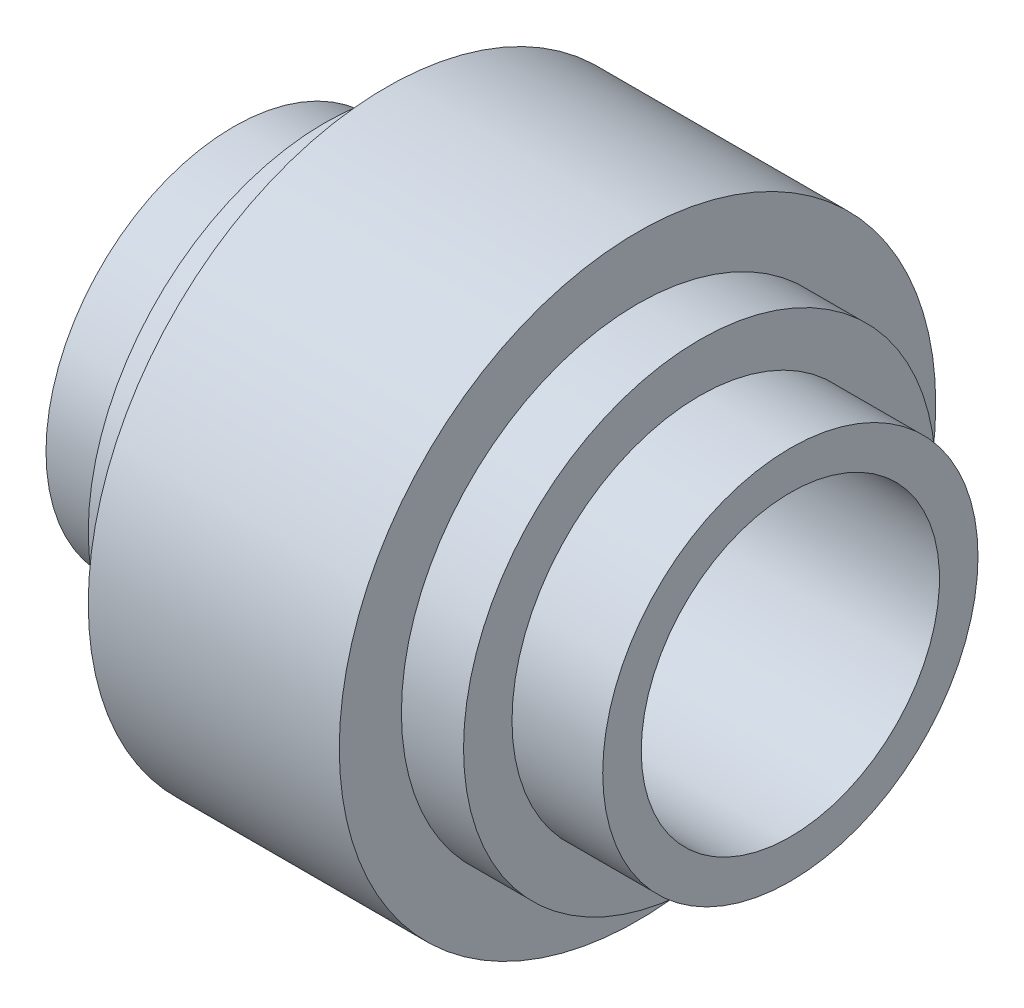
ISO-10303-21;
HEADER;
FILE_DESCRIPTION(('STEP AP214'),'2;1');
FILE_NAME('part.step','',(''),(''),'','','');
FILE_SCHEMA(('AUTOMOTIVE_DESIGN { 1 0 10303 214 1 1 1 1 }'));
ENDSEC;
DATA;
#1=APPLICATION_CONTEXT('core data for automotive mechanical design processes');
#2=APPLICATION_PROTOCOL_DEFINITION('international standard','automotive_design',2000,#1);
#3=PRODUCT_CONTEXT('',#1,'mechanical');
#4=PRODUCT('Part','Part','',(#3));
#5=PRODUCT_RELATED_PRODUCT_CATEGORY('part','',(#4));
#6=PRODUCT_DEFINITION_FORMATION('','',#4);
#7=PRODUCT_DEFINITION_CONTEXT('part definition',#1,'design');
#8=PRODUCT_DEFINITION('design','',#6,#7);
#9=PRODUCT_DEFINITION_SHAPE('','',#8);
#10=(LENGTH_UNIT() NAMED_UNIT(*) SI_UNIT(.MILLI.,.METRE.));
#11=(NAMED_UNIT(*) PLANE_ANGLE_UNIT() SI_UNIT($,.RADIAN.));
#12=(NAMED_UNIT(*) SI_UNIT($,.STERADIAN.) SOLID_ANGLE_UNIT());
#13=UNCERTAINTY_MEASURE_WITH_UNIT(LENGTH_MEASURE(1.E-05),#10,'distance_accuracy_value','');
#14=(GEOMETRIC_REPRESENTATION_CONTEXT(3) GLOBAL_UNCERTAINTY_ASSIGNED_CONTEXT((#13)) GLOBAL_UNIT_ASSIGNED_CONTEXT((#10,
#11,#12)) REPRESENTATION_CONTEXT('',''));
#15=CARTESIAN_POINT('',(0.,0.,0.));
#16=DIRECTION('',(0.,0.,1.));
#17=DIRECTION('',(1.,0.,0.));
#18=AXIS2_PLACEMENT_3D('',#15,#16,#17);
#19=CARTESIAN_POINT('',(0.,0.,0.));
#20=DIRECTION('',(-1.,0.,0.));
#21=DIRECTION('',(0.,0.,1.));
#22=AXIS2_PLACEMENT_3D('',#19,#20,#21);
#23=CYLINDRICAL_SURFACE('',#22,47.5);
#24=CARTESIAN_POINT('',(93.75,0.,0.));
#25=DIRECTION('',(-1.,0.,0.));
#26=DIRECTION('',(0.,0.,1.));
#27=AXIS2_PLACEMENT_3D('',#24,#25,#26);
#28=CIRCLE('',#27,47.5);
#29=CARTESIAN_POINT('',(93.75,0.,47.5));
#30=VERTEX_POINT('',#29);
#31=EDGE_CURVE('E83',#30,#30,#28,.T.);
#32=ORIENTED_EDGE('',*,*,#31,.T.);
#33=EDGE_LOOP('',(#32));
#34=FACE_BOUND('',#33,.T.);
#35=CARTESIAN_POINT('',(81.25,0.,0.));
#36=DIRECTION('',(-1.,0.,0.));
#37=DIRECTION('',(0.,0.,1.));
#38=AXIS2_PLACEMENT_3D('',#35,#36,#37);
#39=CIRCLE('',#38,47.5);
#40=CARTESIAN_POINT('',(81.25,0.,47.5));
#41=VERTEX_POINT('',#40);
#42=EDGE_CURVE('E12',#41,#41,#39,.T.);
#43=ORIENTED_EDGE('',*,*,#42,.F.);
#44=EDGE_LOOP('',(#43));
#45=FACE_BOUND('',#44,.T.);
#46=ADVANCED_FACE('F43',(#34,#45),#23,.T.);
#47=CARTESIAN_POINT('',(81.25,0.,0.));
#48=DIRECTION('',(1.,0.,0.));
#49=DIRECTION('',(0.,0.,-1.));
#50=AXIS2_PLACEMENT_3D('',#47,#48,#49);
#51=PLANE('',#50);
#52=ORIENTED_EDGE('',*,*,#42,.T.);
#53=EDGE_LOOP('',(#52));
#54=FACE_BOUND('',#53,.T.);
#55=CARTESIAN_POINT('',(81.25,0.,0.));
#56=DIRECTION('',(-1.,0.,0.));
#57=DIRECTION('',(0.,0.,1.));
#58=AXIS2_PLACEMENT_3D('',#55,#56,#57);
#59=CIRCLE('',#58,60.);
#60=CARTESIAN_POINT('',(81.25,0.,60.));
#61=VERTEX_POINT('',#60);
#62=EDGE_CURVE('E49',#61,#61,#59,.T.);
#63=ORIENTED_EDGE('',*,*,#62,.F.);
#64=EDGE_LOOP('',(#63));
#65=FACE_BOUND('',#64,.T.);
#66=ADVANCED_FACE('F101',(#54,#65),#51,.T.);
#67=CARTESIAN_POINT('',(0.,0.,0.));
#68=DIRECTION('',(-1.,0.,0.));
#69=DIRECTION('',(0.,0.,1.));
#70=AXIS2_PLACEMENT_3D('',#67,#68,#69);
#71=CYLINDRICAL_SURFACE('',#70,60.);
#72=CARTESIAN_POINT('',(30.75,0.,0.));
#73=DIRECTION('',(-1.,0.,0.));
#74=DIRECTION('',(0.,0.,1.));
#75=AXIS2_PLACEMENT_3D('',#72,#73,#74);
#76=CIRCLE('',#75,60.);
#77=CARTESIAN_POINT('',(30.75,0.,60.));
#78=VERTEX_POINT('',#77);
#79=EDGE_CURVE('E53',#78,#78,#76,.T.);
#80=ORIENTED_EDGE('',*,*,#79,.F.);
#81=EDGE_LOOP('',(#80));
#82=FACE_BOUND('',#81,.T.);
#83=ORIENTED_EDGE('',*,*,#62,.T.);
#84=EDGE_LOOP('',(#83));
#85=FACE_BOUND('',#84,.T.);
#86=ADVANCED_FACE('F105',(#82,#85),#71,.T.);
#87=CARTESIAN_POINT('',(30.75,0.,0.));
#88=DIRECTION('',(1.,0.,0.));
#89=DIRECTION('',(0.,0.,-1.));
#90=AXIS2_PLACEMENT_3D('',#87,#88,#89);
#91=PLANE('',#90);
#92=CARTESIAN_POINT('',(30.75,0.,0.));
#93=DIRECTION('',(-1.,0.,0.));
#94=DIRECTION('',(0.,0.,1.));
#95=AXIS2_PLACEMENT_3D('',#92,#93,#94);
#96=CIRCLE('',#95,47.5);
#97=CARTESIAN_POINT('',(30.75,0.,47.5));
#98=VERTEX_POINT('',#97);
#99=EDGE_CURVE('E57',#98,#98,#96,.T.);
#100=ORIENTED_EDGE('',*,*,#99,.F.);
#101=EDGE_LOOP('',(#100));
#102=FACE_BOUND('',#101,.T.);
#103=ORIENTED_EDGE('',*,*,#79,.T.);
#104=EDGE_LOOP('',(#103));
#105=FACE_BOUND('',#104,.T.);
#106=ADVANCED_FACE('F109',(#102,#105),#91,.F.);
#107=CARTESIAN_POINT('',(0.,0.,0.));
#108=DIRECTION('',(-1.,0.,0.));
#109=DIRECTION('',(0.,0.,1.));
#110=AXIS2_PLACEMENT_3D('',#107,#108,#109);
#111=CYLINDRICAL_SURFACE('',#110,47.5);
#112=CARTESIAN_POINT('',(18.25,0.,0.));
#113=DIRECTION('',(-1.,0.,0.));
#114=DIRECTION('',(0.,0.,1.));
#115=AXIS2_PLACEMENT_3D('',#112,#113,#114);
#116=CIRCLE('',#115,47.5);
#117=CARTESIAN_POINT('',(18.25,0.,47.5));
#118=VERTEX_POINT('',#117);
#119=EDGE_CURVE('E62',#118,#118,#116,.T.);
#120=ORIENTED_EDGE('',*,*,#119,.F.);
#121=EDGE_LOOP('',(#120));
#122=FACE_BOUND('',#121,.T.);
#123=ORIENTED_EDGE('',*,*,#99,.T.);
#124=EDGE_LOOP('',(#123));
#125=FACE_BOUND('',#124,.T.);
#126=ADVANCED_FACE('F116',(#122,#125),#111,.T.);
#127=CARTESIAN_POINT('',(18.25,0.,0.));
#128=DIRECTION('',(1.,0.,0.));
#129=DIRECTION('',(0.,0.,-1.));
#130=AXIS2_PLACEMENT_3D('',#127,#128,#129);
#131=PLANE('',#130);
#132=CARTESIAN_POINT('',(18.25,0.,0.));
#133=DIRECTION('',(-1.,0.,0.));
#134=DIRECTION('',(0.,0.,1.));
#135=AXIS2_PLACEMENT_3D('',#132,#133,#134);
#136=CIRCLE('',#135,37.75);
#137=CARTESIAN_POINT('',(18.25,0.,37.75));
#138=VERTEX_POINT('',#137);
#139=EDGE_CURVE('E65',#138,#138,#136,.T.);
#140=ORIENTED_EDGE('',*,*,#139,.F.);
#141=EDGE_LOOP('',(#140));
#142=FACE_BOUND('',#141,.T.);
#143=ORIENTED_EDGE('',*,*,#119,.T.);
#144=EDGE_LOOP('',(#143));
#145=FACE_BOUND('',#144,.T.);
#146=ADVANCED_FACE('F120',(#142,#145),#131,.F.);
#147=CARTESIAN_POINT('',(0.,0.,0.));
#148=DIRECTION('',(-1.,0.,0.));
#149=DIRECTION('',(0.,0.,1.));
#150=AXIS2_PLACEMENT_3D('',#147,#148,#149);
#151=CYLINDRICAL_SURFACE('',#150,37.75);
#152=CARTESIAN_POINT('',(0.,0.,0.));
#153=DIRECTION('',(-1.,0.,0.));
#154=DIRECTION('',(0.,0.,1.));
#155=AXIS2_PLACEMENT_3D('',#152,#153,#154);
#156=CIRCLE('',#155,37.75);
#157=CARTESIAN_POINT('',(0.,0.,37.75));
#158=VERTEX_POINT('',#157);
#159=EDGE_CURVE('E68',#158,#158,#156,.T.);
#160=ORIENTED_EDGE('',*,*,#159,.F.);
#161=EDGE_LOOP('',(#160));
#162=FACE_BOUND('',#161,.T.);
#163=ORIENTED_EDGE('',*,*,#139,.T.);
#164=EDGE_LOOP('',(#163));
#165=FACE_BOUND('',#164,.T.);
#166=ADVANCED_FACE('F124',(#162,#165),#151,.T.);
#167=CARTESIAN_POINT('',(0.,0.,0.));
#168=DIRECTION('',(1.,0.,0.));
#169=DIRECTION('',(0.,0.,-1.));
#170=AXIS2_PLACEMENT_3D('',#167,#168,#169);
#171=PLANE('',#170);
#172=CARTESIAN_POINT('',(0.,0.,0.));
#173=DIRECTION('',(-1.,0.,0.));
#174=DIRECTION('',(0.,0.,1.));
#175=AXIS2_PLACEMENT_3D('',#172,#173,#174);
#176=CIRCLE('',#175,30.);
#177=CARTESIAN_POINT('',(0.,0.,30.));
#178=VERTEX_POINT('',#177);
#179=EDGE_CURVE('E71',#178,#178,#176,.T.);
#180=ORIENTED_EDGE('',*,*,#179,.F.);
#181=EDGE_LOOP('',(#180));
#182=FACE_BOUND('',#181,.T.);
#183=ORIENTED_EDGE('',*,*,#159,.T.);
#184=EDGE_LOOP('',(#183));
#185=FACE_BOUND('',#184,.T.);
#186=ADVANCED_FACE('F128',(#182,#185),#171,.F.);
#187=CARTESIAN_POINT('',(0.,0.,0.));
#188=DIRECTION('',(-1.,0.,0.));
#189=DIRECTION('',(0.,0.,1.));
#190=AXIS2_PLACEMENT_3D('',#187,#188,#189);
#191=CYLINDRICAL_SURFACE('',#190,30.);
#192=CARTESIAN_POINT('',(112.,0.,0.));
#193=DIRECTION('',(-1.,0.,0.));
#194=DIRECTION('',(0.,0.,1.));
#195=AXIS2_PLACEMENT_3D('',#192,#193,#194);
#196=CIRCLE('',#195,30.);
#197=CARTESIAN_POINT('',(112.,0.,30.));
#198=VERTEX_POINT('',#197);
#199=EDGE_CURVE('E74',#198,#198,#196,.T.);
#200=ORIENTED_EDGE('',*,*,#199,.F.);
#201=EDGE_LOOP('',(#200));
#202=FACE_BOUND('',#201,.T.);
#203=ORIENTED_EDGE('',*,*,#179,.T.);
#204=EDGE_LOOP('',(#203));
#205=FACE_BOUND('',#204,.T.);
#206=ADVANCED_FACE('F132',(#202,#205),#191,.F.);
#207=CARTESIAN_POINT('',(112.,0.,0.));
#208=DIRECTION('',(1.,0.,0.));
#209=DIRECTION('',(0.,0.,-1.));
#210=AXIS2_PLACEMENT_3D('',#207,#208,#209);
#211=PLANE('',#210);
#212=ORIENTED_EDGE('',*,*,#199,.T.);
#213=EDGE_LOOP('',(#212));
#214=FACE_BOUND('',#213,.T.);
#215=CARTESIAN_POINT('',(112.,0.,0.));
#216=DIRECTION('',(-1.,0.,0.));
#217=DIRECTION('',(0.,0.,1.));
#218=AXIS2_PLACEMENT_3D('',#215,#216,#217);
#219=CIRCLE('',#218,37.75);
#220=CARTESIAN_POINT('',(112.,0.,37.75));
#221=VERTEX_POINT('',#220);
#222=EDGE_CURVE('E77',#221,#221,#219,.T.);
#223=ORIENTED_EDGE('',*,*,#222,.F.);
#224=EDGE_LOOP('',(#223));
#225=FACE_BOUND('',#224,.T.);
#226=ADVANCED_FACE('F97',(#214,#225),#211,.T.);
#227=CARTESIAN_POINT('',(0.,0.,0.));
#228=DIRECTION('',(-1.,0.,0.));
#229=DIRECTION('',(0.,0.,1.));
#230=AXIS2_PLACEMENT_3D('',#227,#228,#229);
#231=CYLINDRICAL_SURFACE('',#230,37.75);
#232=ORIENTED_EDGE('',*,*,#222,.T.);
#233=EDGE_LOOP('',(#232));
#234=FACE_BOUND('',#233,.T.);
#235=CARTESIAN_POINT('',(93.75,0.,0.));
#236=DIRECTION('',(-1.,0.,0.));
#237=DIRECTION('',(0.,0.,1.));
#238=AXIS2_PLACEMENT_3D('',#235,#236,#237);
#239=CIRCLE('',#238,37.75);
#240=CARTESIAN_POINT('',(93.75,0.,37.75));
#241=VERTEX_POINT('',#240);
#242=EDGE_CURVE('E80',#241,#241,#239,.T.);
#243=ORIENTED_EDGE('',*,*,#242,.F.);
#244=EDGE_LOOP('',(#243));
#245=FACE_BOUND('',#244,.T.);
#246=ADVANCED_FACE('F91',(#234,#245),#231,.T.);
#247=CARTESIAN_POINT('',(93.75,-2.66880534765662E-13,0.));
#248=DIRECTION('',(1.,0.,0.));
#249=DIRECTION('',(0.,0.,-1.));
#250=AXIS2_PLACEMENT_3D('',#247,#248,#249);
#251=PLANE('',#250);
#252=ORIENTED_EDGE('',*,*,#242,.T.);
#253=EDGE_LOOP('',(#252));
#254=FACE_BOUND('',#253,.T.);
#255=ORIENTED_EDGE('',*,*,#31,.F.);
#256=EDGE_LOOP('',(#255));
#257=FACE_BOUND('',#256,.T.);
#258=ADVANCED_FACE('F89',(#254,#257),#251,.T.);
#259=CLOSED_SHELL('',(#46,#66,#86,#106,#126,#146,#166,#186,#206,#226,#246,#258));
#260=MANIFOLD_SOLID_BREP('B2',#259);
#261=ADVANCED_BREP_SHAPE_REPRESENTATION('',(#18,#260),#14);
#262=SHAPE_DEFINITION_REPRESENTATION(#9,#261);
ENDSEC;
END-ISO-10303-21;
